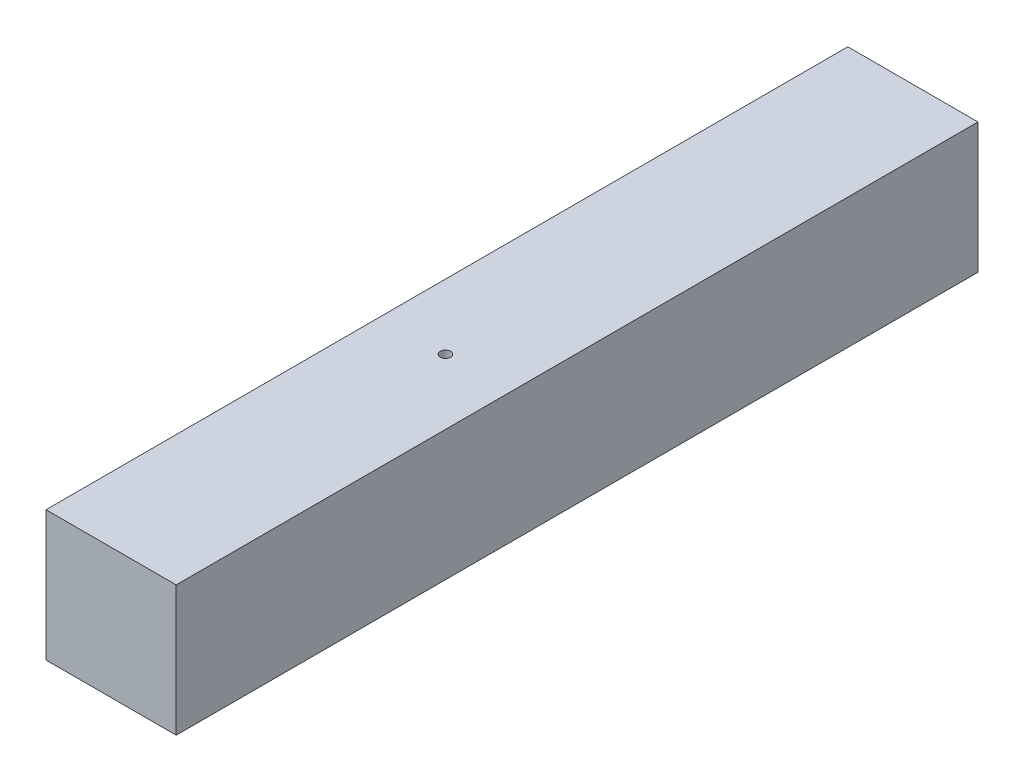
ISO-10303-21;
HEADER;
FILE_DESCRIPTION(('STEP AP214'),'2;1');
FILE_NAME('part.step','',(''),(''),'','','');
FILE_SCHEMA(('AUTOMOTIVE_DESIGN { 1 0 10303 214 1 1 1 1 }'));
ENDSEC;
DATA;
#1=APPLICATION_CONTEXT('core data for automotive mechanical design processes');
#2=APPLICATION_PROTOCOL_DEFINITION('international standard','automotive_design',2000,#1);
#3=PRODUCT_CONTEXT('',#1,'mechanical');
#4=PRODUCT('Part','Part','',(#3));
#5=PRODUCT_RELATED_PRODUCT_CATEGORY('part','',(#4));
#6=PRODUCT_DEFINITION_FORMATION('','',#4);
#7=PRODUCT_DEFINITION_CONTEXT('part definition',#1,'design');
#8=PRODUCT_DEFINITION('design','',#6,#7);
#9=PRODUCT_DEFINITION_SHAPE('','',#8);
#10=(LENGTH_UNIT() NAMED_UNIT(*) SI_UNIT(.MILLI.,.METRE.));
#11=(NAMED_UNIT(*) PLANE_ANGLE_UNIT() SI_UNIT($,.RADIAN.));
#12=(NAMED_UNIT(*) SI_UNIT($,.STERADIAN.) SOLID_ANGLE_UNIT());
#13=UNCERTAINTY_MEASURE_WITH_UNIT(LENGTH_MEASURE(1.E-05),#10,'distance_accuracy_value','');
#14=(GEOMETRIC_REPRESENTATION_CONTEXT(3) GLOBAL_UNCERTAINTY_ASSIGNED_CONTEXT((#13)) GLOBAL_UNIT_ASSIGNED_CONTEXT((#10,
#11,#12)) REPRESENTATION_CONTEXT('',''));
#15=CARTESIAN_POINT('',(0.,0.,0.));
#16=DIRECTION('',(0.,0.,1.));
#17=DIRECTION('',(1.,0.,0.));
#18=AXIS2_PLACEMENT_3D('',#15,#16,#17);
#19=CARTESIAN_POINT('',(-22.,22.,271.));
#20=DIRECTION('',(1.,0.,0.));
#21=DIRECTION('',(0.,1.,0.));
#22=AXIS2_PLACEMENT_3D('',#19,#20,#21);
#23=PLANE('',#22);
#24=DIRECTION('',(0.,-1.,0.));
#25=VECTOR('',#24,1.);
#26=CARTESIAN_POINT('',(-22.,22.,0.));
#27=LINE('',#26,#25);
#28=CARTESIAN_POINT('',(-22.,22.,0.));
#29=VERTEX_POINT('',#28);
#30=CARTESIAN_POINT('',(-22.,-22.,0.));
#31=VERTEX_POINT('',#30);
#32=EDGE_CURVE('E110',#29,#31,#27,.T.);
#33=ORIENTED_EDGE('',*,*,#32,.T.);
#34=DIRECTION('',(0.,0.,-1.));
#35=VECTOR('',#34,1.);
#36=CARTESIAN_POINT('',(-22.,-22.,271.));
#37=LINE('',#36,#35);
#38=CARTESIAN_POINT('',(-22.,-22.,271.));
#39=VERTEX_POINT('',#38);
#40=EDGE_CURVE('E11',#39,#31,#37,.T.);
#41=ORIENTED_EDGE('',*,*,#40,.F.);
#42=DIRECTION('',(0.,-1.,0.));
#43=VECTOR('',#42,1.);
#44=CARTESIAN_POINT('',(-22.,22.,271.));
#45=LINE('',#44,#43);
#46=CARTESIAN_POINT('',(-22.,22.,271.));
#47=VERTEX_POINT('',#46);
#48=EDGE_CURVE('E98',#47,#39,#45,.T.);
#49=ORIENTED_EDGE('',*,*,#48,.F.);
#50=DIRECTION('',(0.,0.,-1.));
#51=VECTOR('',#50,1.);
#52=CARTESIAN_POINT('',(-22.,22.,271.));
#53=LINE('',#52,#51);
#54=EDGE_CURVE('E106',#47,#29,#53,.T.);
#55=ORIENTED_EDGE('',*,*,#54,.T.);
#56=EDGE_LOOP('',(#33,#41,#49,#55));
#57=FACE_BOUND('',#56,.T.);
#58=ADVANCED_FACE('F47',(#57),#23,.F.);
#59=CARTESIAN_POINT('',(22.,-22.,271.));
#60=DIRECTION('',(0.,1.,0.));
#61=DIRECTION('',(-1.,0.,0.));
#62=AXIS2_PLACEMENT_3D('',#59,#60,#61);
#63=PLANE('',#62);
#64=CARTESIAN_POINT('',(0.,-22.,158.));
#65=DIRECTION('',(0.,-1.,0.));
#66=DIRECTION('',(1.,0.,0.));
#67=AXIS2_PLACEMENT_3D('',#64,#65,#66);
#68=CIRCLE('',#67,1.75);
#69=CARTESIAN_POINT('',(1.75,-22.,158.));
#70=VERTEX_POINT('',#69);
#71=EDGE_CURVE('E126',#70,#70,#68,.T.);
#72=ORIENTED_EDGE('',*,*,#71,.F.);
#73=EDGE_LOOP('',(#72));
#74=FACE_BOUND('',#73,.T.);
#75=DIRECTION('',(1.,0.,0.));
#76=VECTOR('',#75,1.);
#77=CARTESIAN_POINT('',(22.,-22.,0.));
#78=LINE('',#77,#76);
#79=CARTESIAN_POINT('',(22.,-22.,0.));
#80=VERTEX_POINT('',#79);
#81=EDGE_CURVE('E102',#31,#80,#78,.T.);
#82=ORIENTED_EDGE('',*,*,#81,.T.);
#83=DIRECTION('',(0.,0.,-1.));
#84=VECTOR('',#83,1.);
#85=CARTESIAN_POINT('',(22.,-22.,271.));
#86=LINE('',#85,#84);
#87=CARTESIAN_POINT('',(22.,-22.,271.));
#88=VERTEX_POINT('',#87);
#89=EDGE_CURVE('E55',#88,#80,#86,.T.);
#90=ORIENTED_EDGE('',*,*,#89,.F.);
#91=DIRECTION('',(1.,0.,0.));
#92=VECTOR('',#91,1.);
#93=CARTESIAN_POINT('',(22.,-22.,271.));
#94=LINE('',#93,#92);
#95=EDGE_CURVE('E93',#39,#88,#94,.T.);
#96=ORIENTED_EDGE('',*,*,#95,.F.);
#97=ORIENTED_EDGE('',*,*,#40,.T.);
#98=EDGE_LOOP('',(#82,#90,#96,#97));
#99=FACE_BOUND('',#98,.T.);
#100=ADVANCED_FACE('F101',(#74,#99),#63,.F.);
#101=CARTESIAN_POINT('',(22.,22.,271.));
#102=DIRECTION('',(-1.,0.,0.));
#103=DIRECTION('',(0.,-1.,0.));
#104=AXIS2_PLACEMENT_3D('',#101,#102,#103);
#105=PLANE('',#104);
#106=DIRECTION('',(0.,1.,0.));
#107=VECTOR('',#106,1.);
#108=CARTESIAN_POINT('',(22.,22.,0.));
#109=LINE('',#108,#107);
#110=CARTESIAN_POINT('',(22.,22.,0.));
#111=VERTEX_POINT('',#110);
#112=EDGE_CURVE('E80',#80,#111,#109,.T.);
#113=ORIENTED_EDGE('',*,*,#112,.T.);
#114=DIRECTION('',(0.,0.,-1.));
#115=VECTOR('',#114,1.);
#116=CARTESIAN_POINT('',(22.,22.,271.));
#117=LINE('',#116,#115);
#118=CARTESIAN_POINT('',(22.,22.,271.));
#119=VERTEX_POINT('',#118);
#120=EDGE_CURVE('E103',#119,#111,#117,.T.);
#121=ORIENTED_EDGE('',*,*,#120,.F.);
#122=DIRECTION('',(0.,1.,0.));
#123=VECTOR('',#122,1.);
#124=CARTESIAN_POINT('',(22.,22.,271.));
#125=LINE('',#124,#123);
#126=EDGE_CURVE('E96',#88,#119,#125,.T.);
#127=ORIENTED_EDGE('',*,*,#126,.F.);
#128=ORIENTED_EDGE('',*,*,#89,.T.);
#129=EDGE_LOOP('',(#113,#121,#127,#128));
#130=FACE_BOUND('',#129,.T.);
#131=ADVANCED_FACE('F104',(#130),#105,.F.);
#132=CARTESIAN_POINT('',(22.,22.,271.));
#133=DIRECTION('',(0.,-1.,0.));
#134=DIRECTION('',(1.,0.,0.));
#135=AXIS2_PLACEMENT_3D('',#132,#133,#134);
#136=PLANE('',#135);
#137=CARTESIAN_POINT('',(0.,22.,158.));
#138=DIRECTION('',(0.,-1.,0.));
#139=DIRECTION('',(1.,0.,0.));
#140=AXIS2_PLACEMENT_3D('',#137,#138,#139);
#141=CIRCLE('',#140,1.75);
#142=CARTESIAN_POINT('',(1.75,22.,158.));
#143=VERTEX_POINT('',#142);
#144=EDGE_CURVE('E113',#143,#143,#141,.F.);
#145=ORIENTED_EDGE('',*,*,#144,.F.);
#146=EDGE_LOOP('',(#145));
#147=FACE_BOUND('',#146,.T.);
#148=DIRECTION('',(-1.,0.,0.));
#149=VECTOR('',#148,1.);
#150=CARTESIAN_POINT('',(22.,22.,0.));
#151=LINE('',#150,#149);
#152=EDGE_CURVE('E86',#111,#29,#151,.T.);
#153=ORIENTED_EDGE('',*,*,#152,.T.);
#154=ORIENTED_EDGE('',*,*,#54,.F.);
#155=DIRECTION('',(-1.,0.,0.));
#156=VECTOR('',#155,1.);
#157=CARTESIAN_POINT('',(22.,22.,271.));
#158=LINE('',#157,#156);
#159=EDGE_CURVE('E63',#119,#47,#158,.T.);
#160=ORIENTED_EDGE('',*,*,#159,.F.);
#161=ORIENTED_EDGE('',*,*,#120,.T.);
#162=EDGE_LOOP('',(#153,#154,#160,#161));
#163=FACE_BOUND('',#162,.T.);
#164=ADVANCED_FACE('F118',(#147,#163),#136,.F.);
#165=CARTESIAN_POINT('',(0.,0.,271.));
#166=DIRECTION('',(0.,0.,-1.));
#167=DIRECTION('',(-1.,0.,0.));
#168=AXIS2_PLACEMENT_3D('',#165,#166,#167);
#169=PLANE('',#168);
#170=ORIENTED_EDGE('',*,*,#48,.T.);
#171=ORIENTED_EDGE('',*,*,#95,.T.);
#172=ORIENTED_EDGE('',*,*,#126,.T.);
#173=ORIENTED_EDGE('',*,*,#159,.T.);
#174=EDGE_LOOP('',(#170,#171,#172,#173));
#175=FACE_BOUND('',#174,.T.);
#176=ADVANCED_FACE('F94',(#175),#169,.F.);
#177=CARTESIAN_POINT('',(0.,0.,0.));
#178=DIRECTION('',(0.,0.,-1.));
#179=DIRECTION('',(-1.,0.,0.));
#180=AXIS2_PLACEMENT_3D('',#177,#178,#179);
#181=PLANE('',#180);
#182=CARTESIAN_POINT('',(0.,0.,0.));
#183=DIRECTION('',(0.,0.,-1.));
#184=DIRECTION('',(-1.,0.,0.));
#185=AXIS2_PLACEMENT_3D('',#182,#183,#184);
#186=CIRCLE('',#185,1.75);
#187=CARTESIAN_POINT('',(-1.75,0.,0.));
#188=VERTEX_POINT('',#187);
#189=EDGE_CURVE('E130',#188,#188,#186,.T.);
#190=ORIENTED_EDGE('',*,*,#189,.F.);
#191=EDGE_LOOP('',(#190));
#192=FACE_BOUND('',#191,.T.);
#193=ORIENTED_EDGE('',*,*,#32,.F.);
#194=ORIENTED_EDGE('',*,*,#152,.F.);
#195=ORIENTED_EDGE('',*,*,#112,.F.);
#196=ORIENTED_EDGE('',*,*,#81,.F.);
#197=EDGE_LOOP('',(#193,#194,#195,#196));
#198=FACE_BOUND('',#197,.T.);
#199=ADVANCED_FACE('F121',(#192,#198),#181,.T.);
#200=CARTESIAN_POINT('',(0.,26.9497474683058,158.));
#201=DIRECTION('',(0.,-1.,0.));
#202=DIRECTION('',(1.,0.,0.));
#203=AXIS2_PLACEMENT_3D('',#200,#201,#202);
#204=CYLINDRICAL_SURFACE('',#203,1.75);
#205=ORIENTED_EDGE('',*,*,#144,.T.);
#206=EDGE_LOOP('',(#205));
#207=FACE_BOUND('',#206,.T.);
#208=ORIENTED_EDGE('',*,*,#71,.T.);
#209=EDGE_LOOP('',(#208));
#210=FACE_BOUND('',#209,.T.);
#211=ADVANCED_FACE('F141',(#207,#210),#204,.F.);
#212=CARTESIAN_POINT('',(0.,0.,60.));
#213=DIRECTION('',(0.,0.,-1.));
#214=DIRECTION('',(-1.,0.,0.));
#215=AXIS2_PLACEMENT_3D('',#212,#213,#214);
#216=CYLINDRICAL_SURFACE('',#215,1.75);
#217=CARTESIAN_POINT('',(0.,0.,60.));
#218=DIRECTION('',(0.,0.,-1.));
#219=DIRECTION('',(-1.,0.,0.));
#220=AXIS2_PLACEMENT_3D('',#217,#218,#219);
#221=CIRCLE('',#220,1.75);
#222=CARTESIAN_POINT('',(-1.75,0.,60.));
#223=VERTEX_POINT('',#222);
#224=EDGE_CURVE('E129',#223,#223,#221,.T.);
#225=ORIENTED_EDGE('',*,*,#224,.F.);
#226=EDGE_LOOP('',(#225));
#227=FACE_BOUND('',#226,.T.);
#228=ORIENTED_EDGE('',*,*,#189,.T.);
#229=EDGE_LOOP('',(#228));
#230=FACE_BOUND('',#229,.T.);
#231=ADVANCED_FACE('F138',(#227,#230),#216,.F.);
#232=CARTESIAN_POINT('',(0.,0.,60.));
#233=DIRECTION('',(0.,0.,-1.));
#234=DIRECTION('',(-1.,0.,0.));
#235=AXIS2_PLACEMENT_3D('',#232,#233,#234);
#236=PLANE('',#235);
#237=ORIENTED_EDGE('',*,*,#224,.T.);
#238=EDGE_LOOP('',(#237));
#239=FACE_BOUND('',#238,.T.);
#240=ADVANCED_FACE('F136',(#239),#236,.T.);
#241=CLOSED_SHELL('',(#58,#100,#131,#164,#176,#199,#211,#231,#240));
#242=MANIFOLD_SOLID_BREP('B2',#241);
#243=ADVANCED_BREP_SHAPE_REPRESENTATION('',(#18,#242),#14);
#244=SHAPE_DEFINITION_REPRESENTATION(#9,#243);
ENDSEC;
END-ISO-10303-21;
